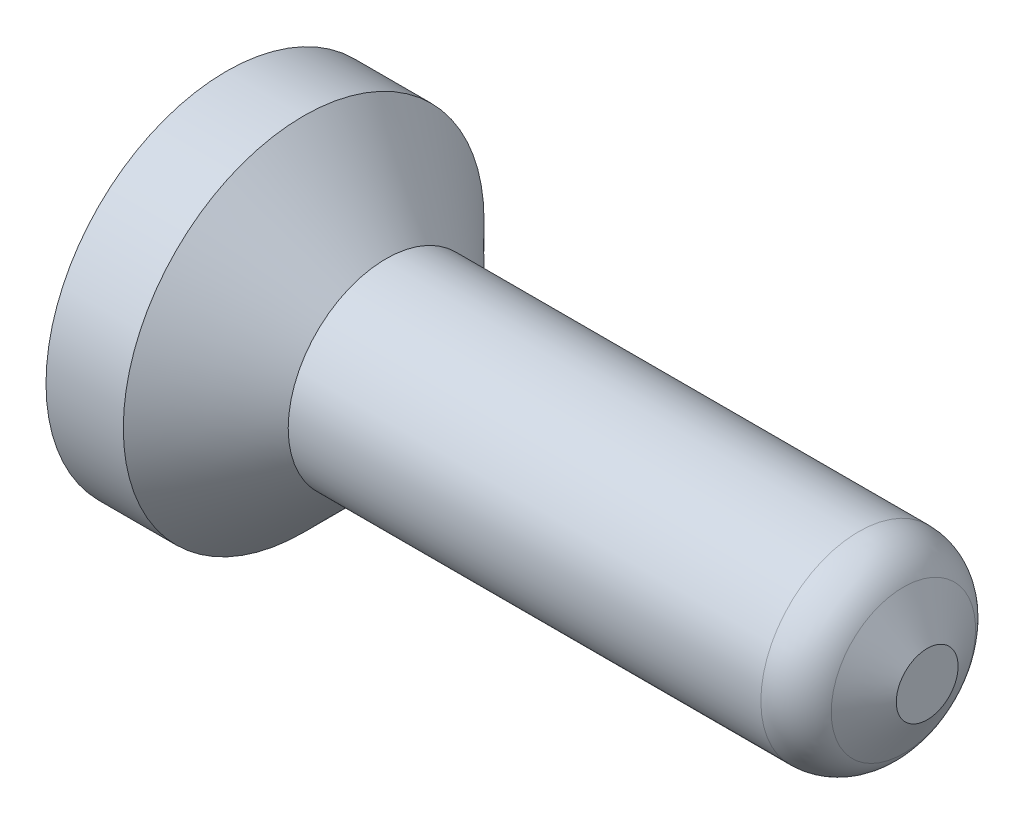
ISO-10303-21;
HEADER;
FILE_DESCRIPTION(('STEP AP214'),'2;1');
FILE_NAME('part.step','',(''),(''),'','','');
FILE_SCHEMA(('AUTOMOTIVE_DESIGN { 1 0 10303 214 1 1 1 1 }'));
ENDSEC;
DATA;
#1=APPLICATION_CONTEXT('core data for automotive mechanical design processes');
#2=APPLICATION_PROTOCOL_DEFINITION('international standard','automotive_design',2000,#1);
#3=PRODUCT_CONTEXT('',#1,'mechanical');
#4=PRODUCT('Part','Part','',(#3));
#5=PRODUCT_RELATED_PRODUCT_CATEGORY('part','',(#4));
#6=PRODUCT_DEFINITION_FORMATION('','',#4);
#7=PRODUCT_DEFINITION_CONTEXT('part definition',#1,'design');
#8=PRODUCT_DEFINITION('design','',#6,#7);
#9=PRODUCT_DEFINITION_SHAPE('','',#8);
#10=(LENGTH_UNIT() NAMED_UNIT(*) SI_UNIT(.MILLI.,.METRE.));
#11=(NAMED_UNIT(*) PLANE_ANGLE_UNIT() SI_UNIT($,.RADIAN.));
#12=(NAMED_UNIT(*) SI_UNIT($,.STERADIAN.) SOLID_ANGLE_UNIT());
#13=UNCERTAINTY_MEASURE_WITH_UNIT(LENGTH_MEASURE(1.E-05),#10,'distance_accuracy_value','');
#14=(GEOMETRIC_REPRESENTATION_CONTEXT(3) GLOBAL_UNCERTAINTY_ASSIGNED_CONTEXT((#13)) GLOBAL_UNIT_ASSIGNED_CONTEXT((#10,
#11,#12)) REPRESENTATION_CONTEXT('',''));
#15=CARTESIAN_POINT('',(0.,0.,0.));
#16=DIRECTION('',(0.,0.,1.));
#17=DIRECTION('',(1.,0.,0.));
#18=AXIS2_PLACEMENT_3D('',#15,#16,#17);
#19=CARTESIAN_POINT('',(3.45440000000002,0.,0.));
#20=DIRECTION('',(-1.,0.,0.));
#21=DIRECTION('',(0.,0.,1.));
#22=AXIS2_PLACEMENT_3D('',#19,#20,#21);
#23=CONICAL_SURFACE('',#22,0.152400000000025,1.04719755119673);
#24=CARTESIAN_POINT('',(3.33708242530076,0.,0.));
#25=DIRECTION('',(-1.,0.,0.));
#26=DIRECTION('',(0.,0.,1.));
#27=AXIS2_PLACEMENT_3D('',#24,#25,#26);
#28=CIRCLE('',#27,0.355599999999963);
#29=CARTESIAN_POINT('',(3.33708242530076,0.,0.355599999999963));
#30=VERTEX_POINT('',#29);
#31=EDGE_CURVE('E10',#30,#30,#28,.T.);
#32=ORIENTED_EDGE('',*,*,#31,.F.);
#33=EDGE_LOOP('',(#32));
#34=FACE_BOUND('',#33,.T.);
#35=CARTESIAN_POINT('',(3.45440000000002,0.,0.));
#36=DIRECTION('',(-1.,0.,0.));
#37=DIRECTION('',(0.,0.,1.));
#38=AXIS2_PLACEMENT_3D('',#35,#36,#37);
#39=CIRCLE('',#38,0.152400000000025);
#40=CARTESIAN_POINT('',(3.45440000000002,0.,0.152400000000025));
#41=VERTEX_POINT('',#40);
#42=EDGE_CURVE('E35',#41,#41,#39,.T.);
#43=ORIENTED_EDGE('',*,*,#42,.T.);
#44=EDGE_LOOP('',(#43));
#45=FACE_BOUND('',#44,.T.);
#46=ADVANCED_FACE('F16',(#34,#45),#23,.T.);
#47=CARTESIAN_POINT('',(3.11711197273944,0.,0.));
#48=DIRECTION('',(-1.,0.,0.));
#49=DIRECTION('',(0.,0.,1.));
#50=AXIS2_PLACEMENT_3D('',#47,#48,#49);
#51=DEGENERATE_TOROIDAL_SURFACE('',#50,0.22859999999994,0.25400000000008,.T.);
#52=CARTESIAN_POINT('',(3.11711197273942,0.,0.));
#53=DIRECTION('',(-1.,0.,0.));
#54=DIRECTION('',(0.,0.,1.));
#55=AXIS2_PLACEMENT_3D('',#52,#53,#54);
#56=CIRCLE('',#55,0.482600000000027);
#57=CARTESIAN_POINT('',(3.11711197273942,0.,0.482600000000027));
#58=VERTEX_POINT('',#57);
#59=EDGE_CURVE('E22',#58,#58,#56,.T.);
#60=ORIENTED_EDGE('',*,*,#59,.F.);
#61=EDGE_LOOP('',(#60));
#62=FACE_BOUND('',#61,.T.);
#63=ORIENTED_EDGE('',*,*,#31,.T.);
#64=EDGE_LOOP('',(#63));
#65=FACE_BOUND('',#64,.T.);
#66=ADVANCED_FACE('F58',(#62,#65),#51,.T.);
#67=CARTESIAN_POINT('',(3.45440000000005,0.,0.));
#68=DIRECTION('',(-1.,0.,0.));
#69=DIRECTION('',(0.,0.,1.));
#70=AXIS2_PLACEMENT_3D('',#67,#68,#69);
#71=CYLINDRICAL_SURFACE('',#70,0.482600000000027);
#72=CARTESIAN_POINT('',(0.787400000000021,0.,0.));
#73=DIRECTION('',(-1.,0.,0.));
#74=DIRECTION('',(0.,0.,1.));
#75=AXIS2_PLACEMENT_3D('',#72,#73,#74);
#76=CIRCLE('',#75,0.482600000000027);
#77=CARTESIAN_POINT('',(0.787400000000021,0.,0.482600000000027));
#78=VERTEX_POINT('',#77);
#79=EDGE_CURVE('E51',#78,#78,#76,.T.);
#80=ORIENTED_EDGE('',*,*,#79,.F.);
#81=EDGE_LOOP('',(#80));
#82=FACE_BOUND('',#81,.T.);
#83=ORIENTED_EDGE('',*,*,#59,.T.);
#84=EDGE_LOOP('',(#83));
#85=FACE_BOUND('',#84,.T.);
#86=ADVANCED_FACE('F56',(#82,#85),#71,.T.);
#87=CARTESIAN_POINT('',(0.787400000000021,0.,0.));
#88=DIRECTION('',(-1.,0.,0.));
#89=DIRECTION('',(0.,0.,1.));
#90=AXIS2_PLACEMENT_3D('',#87,#88,#89);
#91=CONICAL_SURFACE('',#90,0.482600000000027,0.785398163397396);
#92=CARTESIAN_POINT('',(0.381000000000005,0.,0.));
#93=DIRECTION('',(-1.,0.,0.));
#94=DIRECTION('',(0.,0.,1.));
#95=AXIS2_PLACEMENT_3D('',#92,#93,#94);
#96=CIRCLE('',#95,0.889000000000001);
#97=CARTESIAN_POINT('',(0.381000000000005,0.,0.889000000000001));
#98=VERTEX_POINT('',#97);
#99=EDGE_CURVE('E48',#98,#98,#96,.T.);
#100=ORIENTED_EDGE('',*,*,#99,.F.);
#101=EDGE_LOOP('',(#100));
#102=FACE_BOUND('',#101,.T.);
#103=ORIENTED_EDGE('',*,*,#79,.T.);
#104=EDGE_LOOP('',(#103));
#105=FACE_BOUND('',#104,.T.);
#106=ADVANCED_FACE('F82',(#102,#105),#91,.T.);
#107=CARTESIAN_POINT('',(3.45440000000005,0.,0.));
#108=DIRECTION('',(-1.,0.,0.));
#109=DIRECTION('',(0.,0.,1.));
#110=AXIS2_PLACEMENT_3D('',#107,#108,#109);
#111=CYLINDRICAL_SURFACE('',#110,0.889000000000001);
#112=CARTESIAN_POINT('',(0.,0.,0.));
#113=DIRECTION('',(-1.,0.,0.));
#114=DIRECTION('',(0.,0.,1.));
#115=AXIS2_PLACEMENT_3D('',#112,#113,#114);
#116=CIRCLE('',#115,0.889000000000001);
#117=CARTESIAN_POINT('',(0.,0.,0.889000000000001));
#118=VERTEX_POINT('',#117);
#119=EDGE_CURVE('E39',#118,#118,#116,.T.);
#120=ORIENTED_EDGE('',*,*,#119,.F.);
#121=EDGE_LOOP('',(#120));
#122=FACE_BOUND('',#121,.T.);
#123=ORIENTED_EDGE('',*,*,#99,.T.);
#124=EDGE_LOOP('',(#123));
#125=FACE_BOUND('',#124,.T.);
#126=ADVANCED_FACE('F75',(#122,#125),#111,.T.);
#127=CARTESIAN_POINT('',(0.,0.,0.));
#128=DIRECTION('',(1.,0.,0.));
#129=DIRECTION('',(0.,0.,-1.));
#130=AXIS2_PLACEMENT_3D('',#127,#128,#129);
#131=PLANE('',#130);
#132=CARTESIAN_POINT('',(0.,0.,0.));
#133=DIRECTION('',(-1.,0.,0.));
#134=DIRECTION('',(0.,0.,1.));
#135=AXIS2_PLACEMENT_3D('',#132,#133,#134);
#136=CIRCLE('',#135,0.749300000000001);
#137=CARTESIAN_POINT('',(0.,0.,0.749300000000001));
#138=VERTEX_POINT('',#137);
#139=EDGE_CURVE('E42',#138,#138,#136,.T.);
#140=ORIENTED_EDGE('',*,*,#139,.F.);
#141=EDGE_LOOP('',(#140));
#142=FACE_BOUND('',#141,.T.);
#143=ORIENTED_EDGE('',*,*,#119,.T.);
#144=EDGE_LOOP('',(#143));
#145=FACE_BOUND('',#144,.T.);
#146=ADVANCED_FACE('F68',(#142,#145),#131,.F.);
#147=CARTESIAN_POINT('',(3.45440000000004,0.152400000000025,0.));
#148=DIRECTION('',(-1.,0.,0.));
#149=DIRECTION('',(0.,0.,1.));
#150=AXIS2_PLACEMENT_3D('',#147,#148,#149);
#151=PLANE('',#150);
#152=ORIENTED_EDGE('',*,*,#42,.F.);
#153=EDGE_LOOP('',(#152));
#154=FACE_BOUND('',#153,.T.);
#155=ADVANCED_FACE('F29',(#154),#151,.F.);
#156=CARTESIAN_POINT('',(3.0988,0.,0.));
#157=DIRECTION('',(-1.,0.,0.));
#158=DIRECTION('',(0.,0.,1.));
#159=AXIS2_PLACEMENT_3D('',#156,#157,#158);
#160=CONICAL_SURFACE('',#159,0.3937,1.02974425867666);
#161=CARTESIAN_POINT('',(3.33535882571115,0.,0.));
#162=VERTEX_POINT('',#161);
#163=VERTEX_LOOP('',#162);
#164=FACE_BOUND('',#163,.T.);
#165=CARTESIAN_POINT('',(3.0988,0.,0.));
#166=DIRECTION('',(-1.,0.,0.));
#167=DIRECTION('',(0.,0.,1.));
#168=AXIS2_PLACEMENT_3D('',#165,#166,#167);
#169=CIRCLE('',#168,0.3937);
#170=CARTESIAN_POINT('',(3.0988,0.,0.3937));
#171=VERTEX_POINT('',#170);
#172=EDGE_CURVE('E33',#171,#171,#169,.T.);
#173=ORIENTED_EDGE('',*,*,#172,.T.);
#174=EDGE_LOOP('',(#173));
#175=FACE_BOUND('',#174,.T.);
#176=ADVANCED_FACE('F25',(#164,#175),#160,.F.);
#177=CARTESIAN_POINT('',(0.,0.,0.));
#178=DIRECTION('',(-1.,0.,0.));
#179=DIRECTION('',(0.,0.,1.));
#180=AXIS2_PLACEMENT_3D('',#177,#178,#179);
#181=CYLINDRICAL_SURFACE('',#180,0.3937);
#182=ORIENTED_EDGE('',*,*,#172,.F.);
#183=EDGE_LOOP('',(#182));
#184=FACE_BOUND('',#183,.T.);
#185=CARTESIAN_POINT('',(0.355599999999999,0.,0.));
#186=DIRECTION('',(-1.,0.,0.));
#187=DIRECTION('',(0.,0.,1.));
#188=AXIS2_PLACEMENT_3D('',#185,#186,#187);
#189=CIRCLE('',#188,0.3937);
#190=CARTESIAN_POINT('',(0.355599999999999,0.,0.3937));
#191=VERTEX_POINT('',#190);
#192=EDGE_CURVE('E36',#191,#191,#189,.T.);
#193=ORIENTED_EDGE('',*,*,#192,.T.);
#194=EDGE_LOOP('',(#193));
#195=FACE_BOUND('',#194,.T.);
#196=ADVANCED_FACE('F28',(#184,#195),#181,.F.);
#197=CARTESIAN_POINT('',(0.,0.,0.));
#198=DIRECTION('',(-1.,0.,0.));
#199=DIRECTION('',(0.,0.,1.));
#200=AXIS2_PLACEMENT_3D('',#197,#198,#199);
#201=CONICAL_SURFACE('',#200,0.749300000000001,0.785398163397448);
#202=ORIENTED_EDGE('',*,*,#192,.F.);
#203=EDGE_LOOP('',(#202));
#204=FACE_BOUND('',#203,.T.);
#205=ORIENTED_EDGE('',*,*,#139,.T.);
#206=EDGE_LOOP('',(#205));
#207=FACE_BOUND('',#206,.T.);
#208=ADVANCED_FACE('F145',(#204,#207),#201,.F.);
#209=CLOSED_SHELL('',(#46,#66,#86,#106,#126,#146,#155,#176,#196,#208));
#210=MANIFOLD_SOLID_BREP('B1',#209);
#211=ADVANCED_BREP_SHAPE_REPRESENTATION('',(#18,#210),#14);
#212=SHAPE_DEFINITION_REPRESENTATION(#9,#211);
ENDSEC;
END-ISO-10303-21;
